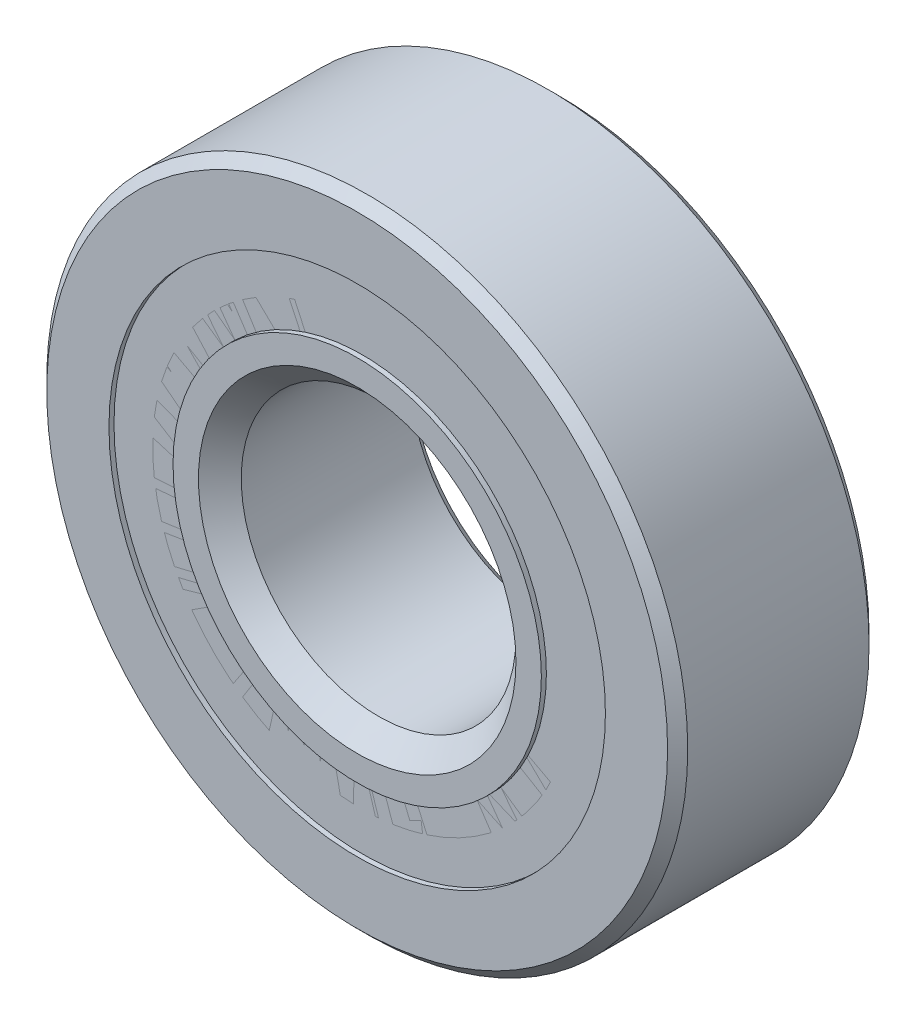
ISO-10303-21;
HEADER;
FILE_DESCRIPTION(('STEP AP214'),'2;1');
FILE_NAME('part.step','',(''),(''),'','','');
FILE_SCHEMA(('AUTOMOTIVE_DESIGN { 1 0 10303 214 1 1 1 1 }'));
ENDSEC;
DATA;
#1=APPLICATION_CONTEXT('core data for automotive mechanical design processes');
#2=APPLICATION_PROTOCOL_DEFINITION('international standard','automotive_design',2000,#1);
#3=PRODUCT_CONTEXT('',#1,'mechanical');
#4=PRODUCT('Part','Part','',(#3));
#5=PRODUCT_RELATED_PRODUCT_CATEGORY('part','',(#4));
#6=PRODUCT_DEFINITION_FORMATION('','',#4);
#7=PRODUCT_DEFINITION_CONTEXT('part definition',#1,'design');
#8=PRODUCT_DEFINITION('design','',#6,#7);
#9=PRODUCT_DEFINITION_SHAPE('','',#8);
#10=(LENGTH_UNIT() NAMED_UNIT(*) SI_UNIT(.MILLI.,.METRE.));
#11=(NAMED_UNIT(*) PLANE_ANGLE_UNIT() SI_UNIT($,.RADIAN.));
#12=(NAMED_UNIT(*) SI_UNIT($,.STERADIAN.) SOLID_ANGLE_UNIT());
#13=UNCERTAINTY_MEASURE_WITH_UNIT(LENGTH_MEASURE(1.E-05),#10,'distance_accuracy_value','');
#14=(GEOMETRIC_REPRESENTATION_CONTEXT(3) GLOBAL_UNCERTAINTY_ASSIGNED_CONTEXT((#13)) GLOBAL_UNIT_ASSIGNED_CONTEXT((#10,
#11,#12)) REPRESENTATION_CONTEXT('',''));
#15=CARTESIAN_POINT('',(0.,0.,0.));
#16=DIRECTION('',(0.,0.,1.));
#17=DIRECTION('',(1.,0.,0.));
#18=AXIS2_PLACEMENT_3D('',#15,#16,#17);
#19=CARTESIAN_POINT('',(0.,13.5549450549451,-5.22500000000001));
#20=DIRECTION('',(0.,0.,1.));
#21=DIRECTION('',(1.,0.,0.));
#22=AXIS2_PLACEMENT_3D('',#19,#20,#21);
#23=PLANE('',#22);
#24=CARTESIAN_POINT('',(0.,0.,-5.22500000000001));
#25=DIRECTION('',(0.,0.,1.));
#26=DIRECTION('',(1.,0.,0.));
#27=AXIS2_PLACEMENT_3D('',#24,#25,#26);
#28=CIRCLE('',#27,13.5549450549451);
#29=CARTESIAN_POINT('',(13.5549450549451,0.,-5.22500000000001));
#30=VERTEX_POINT('',#29);
#31=EDGE_CURVE('E58',#30,#30,#28,.T.);
#32=ORIENTED_EDGE('',*,*,#31,.F.);
#33=EDGE_LOOP('',(#32));
#34=FACE_BOUND('',#33,.T.);
#35=CARTESIAN_POINT('',(0.,0.,-5.22500000000001));
#36=DIRECTION('',(0.,0.,1.));
#37=DIRECTION('',(1.,0.,0.));
#38=AXIS2_PLACEMENT_3D('',#35,#36,#37);
#39=CIRCLE('',#38,10.0569347990905);
#40=CARTESIAN_POINT('',(10.0569347990905,0.,-5.22500000000001));
#41=VERTEX_POINT('',#40);
#42=EDGE_CURVE('E11',#41,#41,#39,.T.);
#43=ORIENTED_EDGE('',*,*,#42,.T.);
#44=EDGE_LOOP('',(#43));
#45=FACE_BOUND('',#44,.T.);
#46=ADVANCED_FACE('F44',(#34,#45),#23,.F.);
#47=CARTESIAN_POINT('',(0.,0.,5.5));
#48=DIRECTION('',(0.,0.,1.));
#49=DIRECTION('',(1.,0.,0.));
#50=AXIS2_PLACEMENT_3D('',#47,#48,#49);
#51=CYLINDRICAL_SURFACE('',#50,10.0569347990905);
#52=ORIENTED_EDGE('',*,*,#42,.F.);
#53=EDGE_LOOP('',(#52));
#54=FACE_BOUND('',#53,.T.);
#55=CARTESIAN_POINT('',(0.,0.,-2.66237069374803));
#56=DIRECTION('',(0.,0.,1.));
#57=DIRECTION('',(1.,0.,0.));
#58=AXIS2_PLACEMENT_3D('',#55,#56,#57);
#59=CIRCLE('',#58,10.0569347990905);
#60=CARTESIAN_POINT('',(10.0569347990905,0.,-2.66237069374803));
#61=VERTEX_POINT('',#60);
#62=EDGE_CURVE('E50',#61,#61,#59,.T.);
#63=ORIENTED_EDGE('',*,*,#62,.T.);
#64=EDGE_LOOP('',(#63));
#65=FACE_BOUND('',#64,.T.);
#66=ADVANCED_FACE('F67',(#54,#65),#51,.F.);
#67=CARTESIAN_POINT('',(0.,13.5549450549451,-2.66237069374803));
#68=DIRECTION('',(0.,0.,-1.));
#69=DIRECTION('',(-1.,0.,0.));
#70=AXIS2_PLACEMENT_3D('',#67,#68,#69);
#71=PLANE('',#70);
#72=ORIENTED_EDGE('',*,*,#62,.F.);
#73=EDGE_LOOP('',(#72));
#74=FACE_BOUND('',#73,.T.);
#75=CARTESIAN_POINT('',(0.,0.,-2.66237069374802));
#76=DIRECTION('',(0.,0.,1.));
#77=DIRECTION('',(1.,0.,0.));
#78=AXIS2_PLACEMENT_3D('',#75,#76,#77);
#79=CIRCLE('',#78,13.5549450549451);
#80=CARTESIAN_POINT('',(13.5549450549451,0.,-2.66237069374802));
#81=VERTEX_POINT('',#80);
#82=EDGE_CURVE('E54',#81,#81,#79,.T.);
#83=ORIENTED_EDGE('',*,*,#82,.T.);
#84=EDGE_LOOP('',(#83));
#85=FACE_BOUND('',#84,.T.);
#86=ADVANCED_FACE('F71',(#74,#85),#71,.F.);
#87=CARTESIAN_POINT('',(0.,0.,5.5));
#88=DIRECTION('',(0.,0.,1.));
#89=DIRECTION('',(1.,0.,0.));
#90=AXIS2_PLACEMENT_3D('',#87,#88,#89);
#91=CYLINDRICAL_SURFACE('',#90,13.5549450549451);
#92=ORIENTED_EDGE('',*,*,#82,.F.);
#93=EDGE_LOOP('',(#92));
#94=FACE_BOUND('',#93,.T.);
#95=ORIENTED_EDGE('',*,*,#31,.T.);
#96=EDGE_LOOP('',(#95));
#97=FACE_BOUND('',#96,.T.);
#98=ADVANCED_FACE('F64',(#94,#97),#91,.T.);
#99=CLOSED_SHELL('',(#46,#66,#86,#98));
#100=MANIFOLD_SOLID_BREP('B2',#99);
#101=CARTESIAN_POINT('',(0.,13.5549450549451,5.225));
#102=DIRECTION('',(0.,0.,-1.));
#103=DIRECTION('',(-1.,0.,0.));
#104=AXIS2_PLACEMENT_3D('',#101,#102,#103);
#105=PLANE('',#104);
#106=CARTESIAN_POINT('',(0.,0.,5.225));
#107=DIRECTION('',(0.,0.,1.));
#108=DIRECTION('',(1.,0.,0.));
#109=AXIS2_PLACEMENT_3D('',#106,#107,#108);
#110=CIRCLE('',#109,10.0569347990905);
#111=CARTESIAN_POINT('',(10.0569347990905,0.,5.225));
#112=VERTEX_POINT('',#111);
#113=EDGE_CURVE('E43',#112,#112,#110,.T.);
#114=ORIENTED_EDGE('',*,*,#113,.F.);
#115=EDGE_LOOP('',(#114));
#116=FACE_BOUND('',#115,.T.);
#117=CARTESIAN_POINT('',(0.,0.,5.225));
#118=DIRECTION('',(0.,0.,1.));
#119=DIRECTION('',(1.,0.,0.));
#120=AXIS2_PLACEMENT_3D('',#117,#118,#119);
#121=CIRCLE('',#120,13.5549450549451);
#122=CARTESIAN_POINT('',(13.5549450549451,0.,5.225));
#123=VERTEX_POINT('',#122);
#124=EDGE_CURVE('E140',#123,#123,#121,.T.);
#125=ORIENTED_EDGE('',*,*,#124,.T.);
#126=EDGE_LOOP('',(#125));
#127=FACE_BOUND('',#126,.T.);
#128=ADVANCED_FACE('F126',(#116,#127),#105,.F.);
#129=CARTESIAN_POINT('',(0.,0.,5.5));
#130=DIRECTION('',(0.,0.,1.));
#131=DIRECTION('',(1.,0.,0.));
#132=AXIS2_PLACEMENT_3D('',#129,#130,#131);
#133=CYLINDRICAL_SURFACE('',#132,10.0569347990905);
#134=CARTESIAN_POINT('',(0.,0.,2.66237069374802));
#135=DIRECTION('',(0.,0.,1.));
#136=DIRECTION('',(1.,0.,0.));
#137=AXIS2_PLACEMENT_3D('',#134,#135,#136);
#138=CIRCLE('',#137,10.0569347990905);
#139=CARTESIAN_POINT('',(10.0569347990905,0.,2.66237069374802));
#140=VERTEX_POINT('',#139);
#141=EDGE_CURVE('E132',#140,#140,#138,.T.);
#142=ORIENTED_EDGE('',*,*,#141,.F.);
#143=EDGE_LOOP('',(#142));
#144=FACE_BOUND('',#143,.T.);
#145=ORIENTED_EDGE('',*,*,#113,.T.);
#146=EDGE_LOOP('',(#145));
#147=FACE_BOUND('',#146,.T.);
#148=ADVANCED_FACE('F155',(#144,#147),#133,.F.);
#149=CARTESIAN_POINT('',(0.,13.5549450549451,2.66237069374802));
#150=DIRECTION('',(0.,0.,1.));
#151=DIRECTION('',(1.,0.,0.));
#152=AXIS2_PLACEMENT_3D('',#149,#150,#151);
#153=PLANE('',#152);
#154=CARTESIAN_POINT('',(0.,0.,2.66237069374802));
#155=DIRECTION('',(0.,0.,1.));
#156=DIRECTION('',(1.,0.,0.));
#157=AXIS2_PLACEMENT_3D('',#154,#155,#156);
#158=CIRCLE('',#157,13.5549450549451);
#159=CARTESIAN_POINT('',(13.5549450549451,0.,2.66237069374802));
#160=VERTEX_POINT('',#159);
#161=EDGE_CURVE('E136',#160,#160,#158,.T.);
#162=ORIENTED_EDGE('',*,*,#161,.F.);
#163=EDGE_LOOP('',(#162));
#164=FACE_BOUND('',#163,.T.);
#165=ORIENTED_EDGE('',*,*,#141,.T.);
#166=EDGE_LOOP('',(#165));
#167=FACE_BOUND('',#166,.T.);
#168=ADVANCED_FACE('F150',(#164,#167),#153,.F.);
#169=CARTESIAN_POINT('',(0.,0.,5.5));
#170=DIRECTION('',(0.,0.,1.));
#171=DIRECTION('',(1.,0.,0.));
#172=AXIS2_PLACEMENT_3D('',#169,#170,#171);
#173=CYLINDRICAL_SURFACE('',#172,13.5549450549451);
#174=ORIENTED_EDGE('',*,*,#124,.F.);
#175=EDGE_LOOP('',(#174));
#176=FACE_BOUND('',#175,.T.);
#177=ORIENTED_EDGE('',*,*,#161,.T.);
#178=EDGE_LOOP('',(#177));
#179=FACE_BOUND('',#178,.T.);
#180=ADVANCED_FACE('F147',(#176,#179),#173,.T.);
#181=CLOSED_SHELL('',(#128,#148,#168,#180));
#182=MANIFOLD_SOLID_BREP('B6',#181);
#183=CARTESIAN_POINT('',(-8.83883476483174,8.83883476483195,0.));
#184=DIRECTION('',(0.,0.,1.));
#185=DIRECTION('',(-0.707106781186539,0.707106781186556,0.));
#186=AXIS2_PLACEMENT_3D('',#183,#184,#185);
#187=SPHERICAL_SURFACE('',#186,2.66237069374802);
#188=CARTESIAN_POINT('',(-8.83883476483174,8.83883476483195,2.66237069374802));
#189=VERTEX_POINT('',#188);
#190=VERTEX_LOOP('',#189);
#191=FACE_BOUND('',#190,.T.);
#192=ADVANCED_FACE('F208',(#191),#187,.T.);
#193=CLOSED_SHELL('',(#192));
#194=MANIFOLD_SOLID_BREP('B38',#193);
#195=CARTESIAN_POINT('',(-12.5,1.30930550206618E-13,0.));
#196=DIRECTION('',(0.,0.,1.));
#197=DIRECTION('',(-1.,0.,0.));
#198=AXIS2_PLACEMENT_3D('',#195,#196,#197);
#199=SPHERICAL_SURFACE('',#198,2.66237069374802);
#200=CARTESIAN_POINT('',(-12.5,1.30930550206618E-13,2.66237069374802));
#201=VERTEX_POINT('',#200);
#202=VERTEX_LOOP('',#201);
#203=FACE_BOUND('',#202,.T.);
#204=ADVANCED_FACE('F241',(#203),#199,.T.);
#205=CLOSED_SHELL('',(#204));
#206=MANIFOLD_SOLID_BREP('B122',#205);
#207=CARTESIAN_POINT('',(-8.83883476483192,-8.83883476483177,0.));
#208=DIRECTION('',(0.,0.,1.));
#209=DIRECTION('',(-0.707106781186554,-0.707106781186541,0.));
#210=AXIS2_PLACEMENT_3D('',#207,#208,#209);
#211=SPHERICAL_SURFACE('',#210,2.66237069374802);
#212=CARTESIAN_POINT('',(-8.83883476483192,-8.83883476483177,2.66237069374802));
#213=VERTEX_POINT('',#212);
#214=VERTEX_LOOP('',#213);
#215=FACE_BOUND('',#214,.T.);
#216=ADVANCED_FACE('F274',(#215),#211,.T.);
#217=CLOSED_SHELL('',(#216));
#218=MANIFOLD_SOLID_BREP('B204',#217);
#219=CARTESIAN_POINT('',(0.,-12.5,0.));
#220=DIRECTION('',(0.,0.,1.));
#221=DIRECTION('',(0.,-1.,0.));
#222=AXIS2_PLACEMENT_3D('',#219,#220,#221);
#223=SPHERICAL_SURFACE('',#222,2.66237069374802);
#224=CARTESIAN_POINT('',(0.,-12.5,2.66237069374802));
#225=VERTEX_POINT('',#224);
#226=VERTEX_LOOP('',#225);
#227=FACE_BOUND('',#226,.T.);
#228=ADVANCED_FACE('F307',(#227),#223,.T.);
#229=CLOSED_SHELL('',(#228));
#230=MANIFOLD_SOLID_BREP('B237',#229);
#231=CARTESIAN_POINT('',(8.8388347648318,-8.83883476483189,0.));
#232=DIRECTION('',(0.,0.,1.));
#233=DIRECTION('',(0.707106781186544,-0.707106781186551,0.));
#234=AXIS2_PLACEMENT_3D('',#231,#232,#233);
#235=SPHERICAL_SURFACE('',#234,2.66237069374802);
#236=CARTESIAN_POINT('',(8.8388347648318,-8.83883476483189,2.66237069374802));
#237=VERTEX_POINT('',#236);
#238=VERTEX_LOOP('',#237);
#239=FACE_BOUND('',#238,.T.);
#240=ADVANCED_FACE('F340',(#239),#235,.T.);
#241=CLOSED_SHELL('',(#240));
#242=MANIFOLD_SOLID_BREP('B270',#241);
#243=CARTESIAN_POINT('',(12.5,0.,0.));
#244=DIRECTION('',(0.,0.,1.));
#245=DIRECTION('',(1.,0.,0.));
#246=AXIS2_PLACEMENT_3D('',#243,#244,#245);
#247=SPHERICAL_SURFACE('',#246,2.66237069374802);
#248=CARTESIAN_POINT('',(12.5,0.,2.66237069374802));
#249=VERTEX_POINT('',#248);
#250=VERTEX_LOOP('',#249);
#251=FACE_BOUND('',#250,.T.);
#252=ADVANCED_FACE('F373',(#251),#247,.T.);
#253=CLOSED_SHELL('',(#252));
#254=MANIFOLD_SOLID_BREP('B303',#253);
#255=CARTESIAN_POINT('',(8.83883476483186,8.83883476483183,0.));
#256=DIRECTION('',(0.,0.,1.));
#257=DIRECTION('',(0.707106781186549,0.707106781186546,0.));
#258=AXIS2_PLACEMENT_3D('',#255,#256,#257);
#259=SPHERICAL_SURFACE('',#258,2.66237069374802);
#260=CARTESIAN_POINT('',(8.83883476483186,8.83883476483183,2.66237069374802));
#261=VERTEX_POINT('',#260);
#262=VERTEX_LOOP('',#261);
#263=FACE_BOUND('',#262,.T.);
#264=ADVANCED_FACE('F406',(#263),#259,.T.);
#265=CLOSED_SHELL('',(#264));
#266=MANIFOLD_SOLID_BREP('B336',#265);
#267=CARTESIAN_POINT('',(0.,12.5,0.));
#268=DIRECTION('',(0.,0.,1.));
#269=DIRECTION('',(0.,1.,0.));
#270=AXIS2_PLACEMENT_3D('',#267,#268,#269);
#271=SPHERICAL_SURFACE('',#270,2.66237069374802);
#272=CARTESIAN_POINT('',(0.,12.5,2.66237069374802));
#273=VERTEX_POINT('',#272);
#274=VERTEX_LOOP('',#273);
#275=FACE_BOUND('',#274,.T.);
#276=ADVANCED_FACE('F441',(#275),#271,.T.);
#277=CLOSED_SHELL('',(#276));
#278=MANIFOLD_SOLID_BREP('B369',#277);
#279=CARTESIAN_POINT('',(0.,0.,5.5));
#280=DIRECTION('',(0.,0.,1.));
#281=DIRECTION('',(1.,0.,0.));
#282=AXIS2_PLACEMENT_3D('',#279,#280,#281);
#283=CYLINDRICAL_SURFACE('',#282,10.0569347990905);
#284=CARTESIAN_POINT('',(0.,0.,5.5));
#285=DIRECTION('',(0.,0.,1.));
#286=DIRECTION('',(1.,0.,0.));
#287=AXIS2_PLACEMENT_3D('',#284,#285,#286);
#288=CIRCLE('',#287,10.0569347990905);
#289=CARTESIAN_POINT('',(10.0569347990905,0.,5.5));
#290=VERTEX_POINT('',#289);
#291=EDGE_CURVE('E502',#290,#290,#288,.T.);
#292=ORIENTED_EDGE('',*,*,#291,.F.);
#293=EDGE_LOOP('',(#292));
#294=FACE_BOUND('',#293,.T.);
#295=CARTESIAN_POINT('',(0.,0.,5.225));
#296=DIRECTION('',(0.,0.,1.));
#297=DIRECTION('',(1.,0.,0.));
#298=AXIS2_PLACEMENT_3D('',#295,#296,#297);
#299=CIRCLE('',#298,10.0569347990905);
#300=CARTESIAN_POINT('',(10.0569347990905,0.,5.225));
#301=VERTEX_POINT('',#300);
#302=EDGE_CURVE('E440',#301,#301,#299,.T.);
#303=ORIENTED_EDGE('',*,*,#302,.T.);
#304=EDGE_LOOP('',(#303));
#305=FACE_BOUND('',#304,.T.);
#306=ADVANCED_FACE('F462',(#294,#305),#283,.T.);
#307=CARTESIAN_POINT('',(0.,10.0569347990905,5.225));
#308=DIRECTION('',(0.,0.,1.));
#309=DIRECTION('',(1.,0.,0.));
#310=AXIS2_PLACEMENT_3D('',#307,#308,#309);
#311=PLANE('',#310);
#312=ORIENTED_EDGE('',*,*,#302,.F.);
#313=EDGE_LOOP('',(#312));
#314=FACE_BOUND('',#313,.T.);
#315=CARTESIAN_POINT('',(0.,0.,5.225));
#316=DIRECTION('',(0.,0.,1.));
#317=DIRECTION('',(1.,0.,0.));
#318=AXIS2_PLACEMENT_3D('',#315,#316,#317);
#319=CIRCLE('',#318,9.78193479909047);
#320=CARTESIAN_POINT('',(9.78193479909047,0.,5.225));
#321=VERTEX_POINT('',#320);
#322=EDGE_CURVE('E468',#321,#321,#319,.T.);
#323=ORIENTED_EDGE('',*,*,#322,.T.);
#324=EDGE_LOOP('',(#323));
#325=FACE_BOUND('',#324,.T.);
#326=ADVANCED_FACE('F509',(#314,#325),#311,.F.);
#327=CARTESIAN_POINT('',(0.,0.,4.11187985403553));
#328=DIRECTION('',(0.,0.,1.));
#329=DIRECTION('',(1.,0.,0.));
#330=AXIS2_PLACEMENT_3D('',#327,#328,#329);
#331=CONICAL_SURFACE('',#330,8.66881465312599,0.78539816339745);
#332=ORIENTED_EDGE('',*,*,#322,.F.);
#333=EDGE_LOOP('',(#332));
#334=FACE_BOUND('',#333,.T.);
#335=CARTESIAN_POINT('',(0.,0.,4.11187985403553));
#336=DIRECTION('',(0.,0.,1.));
#337=DIRECTION('',(1.,0.,0.));
#338=AXIS2_PLACEMENT_3D('',#335,#336,#337);
#339=CIRCLE('',#338,8.66881465312599);
#340=CARTESIAN_POINT('',(8.66881465312599,0.,4.11187985403553));
#341=VERTEX_POINT('',#340);
#342=EDGE_CURVE('E472',#341,#341,#339,.T.);
#343=ORIENTED_EDGE('',*,*,#342,.T.);
#344=EDGE_LOOP('',(#343));
#345=FACE_BOUND('',#344,.T.);
#346=ADVANCED_FACE('F513',(#334,#345),#331,.T.);
#347=CARTESIAN_POINT('',(0.,0.,5.5));
#348=DIRECTION('',(0.,0.,1.));
#349=DIRECTION('',(1.,0.,0.));
#350=AXIS2_PLACEMENT_3D('',#347,#348,#349);
#351=CYLINDRICAL_SURFACE('',#350,8.66881465312599);
#352=ORIENTED_EDGE('',*,*,#342,.F.);
#353=EDGE_LOOP('',(#352));
#354=FACE_BOUND('',#353,.T.);
#355=CARTESIAN_POINT('',(0.,0.,0.));
#356=DIRECTION('',(0.,0.,1.));
#357=DIRECTION('',(1.,0.,0.));
#358=AXIS2_PLACEMENT_3D('',#355,#356,#357);
#359=CIRCLE('',#358,8.66881465312599);
#360=CARTESIAN_POINT('',(8.66881465312599,0.,0.));
#361=VERTEX_POINT('',#360);
#362=EDGE_CURVE('E476',#361,#361,#359,.T.);
#363=ORIENTED_EDGE('',*,*,#362,.T.);
#364=EDGE_LOOP('',(#363));
#365=FACE_BOUND('',#364,.T.);
#366=ADVANCED_FACE('F518',(#354,#365),#351,.T.);
#367=CARTESIAN_POINT('',(0.,8.66881465312599,0.));
#368=DIRECTION('',(0.,0.,-1.));
#369=DIRECTION('',(-1.,0.,0.));
#370=AXIS2_PLACEMENT_3D('',#367,#368,#369);
#371=PLANE('',#370);
#372=ORIENTED_EDGE('',*,*,#362,.F.);
#373=EDGE_LOOP('',(#372));
#374=FACE_BOUND('',#373,.T.);
#375=CARTESIAN_POINT('',(0.,0.,0.));
#376=DIRECTION('',(0.,0.,1.));
#377=DIRECTION('',(1.,0.,0.));
#378=AXIS2_PLACEMENT_3D('',#375,#376,#377);
#379=CIRCLE('',#378,9.83762930625198);
#380=CARTESIAN_POINT('',(9.83762930625198,0.,0.));
#381=VERTEX_POINT('',#380);
#382=EDGE_CURVE('E481',#381,#381,#379,.T.);
#383=ORIENTED_EDGE('',*,*,#382,.T.);
#384=EDGE_LOOP('',(#383));
#385=FACE_BOUND('',#384,.T.);
#386=ADVANCED_FACE('F524',(#374,#385),#371,.F.);
#387=CARTESIAN_POINT('',(0.,0.,0.));
#388=DIRECTION('',(0.,0.,1.));
#389=DIRECTION('',(1.,0.,0.));
#390=AXIS2_PLACEMENT_3D('',#387,#388,#389);
#391=TOROIDAL_SURFACE('',#390,12.5,2.66237069374802);
#392=ORIENTED_EDGE('',*,*,#382,.F.);
#393=EDGE_LOOP('',(#392));
#394=FACE_BOUND('',#393,.T.);
#395=CARTESIAN_POINT('',(0.,0.,-2.44444444444444));
#396=DIRECTION('',(0.,0.,1.));
#397=DIRECTION('',(1.,0.,0.));
#398=AXIS2_PLACEMENT_3D('',#395,#396,#397);
#399=CIRCLE('',#398,11.445054945055);
#400=CARTESIAN_POINT('',(11.445054945055,0.,-2.44444444444444));
#401=VERTEX_POINT('',#400);
#402=EDGE_CURVE('E484',#401,#401,#399,.T.);
#403=ORIENTED_EDGE('',*,*,#402,.T.);
#404=EDGE_LOOP('',(#403));
#405=FACE_BOUND('',#404,.T.);
#406=ADVANCED_FACE('F528',(#394,#405),#391,.F.);
#407=CARTESIAN_POINT('',(0.,0.,5.5));
#408=DIRECTION('',(0.,0.,1.));
#409=DIRECTION('',(1.,0.,0.));
#410=AXIS2_PLACEMENT_3D('',#407,#408,#409);
#411=CYLINDRICAL_SURFACE('',#410,11.445054945055);
#412=ORIENTED_EDGE('',*,*,#402,.F.);
#413=EDGE_LOOP('',(#412));
#414=FACE_BOUND('',#413,.T.);
#415=CARTESIAN_POINT('',(0.,0.,-5.50000000000001));
#416=DIRECTION('',(0.,0.,1.));
#417=DIRECTION('',(1.,0.,0.));
#418=AXIS2_PLACEMENT_3D('',#415,#416,#417);
#419=CIRCLE('',#418,11.445054945055);
#420=CARTESIAN_POINT('',(11.445054945055,0.,-5.50000000000001));
#421=VERTEX_POINT('',#420);
#422=EDGE_CURVE('E487',#421,#421,#419,.T.);
#423=ORIENTED_EDGE('',*,*,#422,.T.);
#424=EDGE_LOOP('',(#423));
#425=FACE_BOUND('',#424,.T.);
#426=ADVANCED_FACE('F532',(#414,#425),#411,.T.);
#427=CARTESIAN_POINT('',(0.,8.05,-5.50000000000001));
#428=DIRECTION('',(0.,0.,1.));
#429=DIRECTION('',(1.,0.,0.));
#430=AXIS2_PLACEMENT_3D('',#427,#428,#429);
#431=PLANE('',#430);
#432=ORIENTED_EDGE('',*,*,#422,.F.);
#433=EDGE_LOOP('',(#432));
#434=FACE_BOUND('',#433,.T.);
#435=CARTESIAN_POINT('',(0.,0.,-5.50000000000001));
#436=DIRECTION('',(0.,0.,1.));
#437=DIRECTION('',(1.,0.,0.));
#438=AXIS2_PLACEMENT_3D('',#435,#436,#437);
#439=CIRCLE('',#438,8.05);
#440=CARTESIAN_POINT('',(8.05,0.,-5.50000000000001));
#441=VERTEX_POINT('',#440);
#442=EDGE_CURVE('E490',#441,#441,#439,.T.);
#443=ORIENTED_EDGE('',*,*,#442,.T.);
#444=EDGE_LOOP('',(#443));
#445=FACE_BOUND('',#444,.T.);
#446=ADVANCED_FACE('F536',(#434,#445),#431,.F.);
#447=CARTESIAN_POINT('',(0.,0.,-4.95000000000001));
#448=DIRECTION('',(0.,0.,-1.));
#449=DIRECTION('',(-1.,0.,0.));
#450=AXIS2_PLACEMENT_3D('',#447,#448,#449);
#451=CONICAL_SURFACE('',#450,7.5,0.785398163397447);
#452=ORIENTED_EDGE('',*,*,#442,.F.);
#453=EDGE_LOOP('',(#452));
#454=FACE_BOUND('',#453,.T.);
#455=CARTESIAN_POINT('',(0.,0.,-4.95000000000001));
#456=DIRECTION('',(0.,0.,1.));
#457=DIRECTION('',(1.,0.,0.));
#458=AXIS2_PLACEMENT_3D('',#455,#456,#457);
#459=CIRCLE('',#458,7.5);
#460=CARTESIAN_POINT('',(7.5,0.,-4.95000000000001));
#461=VERTEX_POINT('',#460);
#462=EDGE_CURVE('E493',#461,#461,#459,.T.);
#463=ORIENTED_EDGE('',*,*,#462,.T.);
#464=EDGE_LOOP('',(#463));
#465=FACE_BOUND('',#464,.T.);
#466=ADVANCED_FACE('F540',(#454,#465),#451,.F.);
#467=CARTESIAN_POINT('',(0.,0.,5.5));
#468=DIRECTION('',(0.,0.,1.));
#469=DIRECTION('',(1.,0.,0.));
#470=AXIS2_PLACEMENT_3D('',#467,#468,#469);
#471=CYLINDRICAL_SURFACE('',#470,7.5);
#472=ORIENTED_EDGE('',*,*,#462,.F.);
#473=EDGE_LOOP('',(#472));
#474=FACE_BOUND('',#473,.T.);
#475=CARTESIAN_POINT('',(0.,0.,4.33118534687402));
#476=DIRECTION('',(0.,0.,1.));
#477=DIRECTION('',(1.,0.,0.));
#478=AXIS2_PLACEMENT_3D('',#475,#476,#477);
#479=CIRCLE('',#478,7.5);
#480=CARTESIAN_POINT('',(7.5,0.,4.33118534687402));
#481=VERTEX_POINT('',#480);
#482=EDGE_CURVE('E496',#481,#481,#479,.T.);
#483=ORIENTED_EDGE('',*,*,#482,.T.);
#484=EDGE_LOOP('',(#483));
#485=FACE_BOUND('',#484,.T.);
#486=ADVANCED_FACE('F544',(#474,#485),#471,.F.);
#487=CARTESIAN_POINT('',(0.,0.,5.5));
#488=DIRECTION('',(0.,0.,1.));
#489=DIRECTION('',(1.,0.,0.));
#490=AXIS2_PLACEMENT_3D('',#487,#488,#489);
#491=CONICAL_SURFACE('',#490,8.66881465312599,0.78539816339745);
#492=ORIENTED_EDGE('',*,*,#482,.F.);
#493=EDGE_LOOP('',(#492));
#494=FACE_BOUND('',#493,.T.);
#495=CARTESIAN_POINT('',(0.,0.,5.5));
#496=DIRECTION('',(0.,0.,1.));
#497=DIRECTION('',(1.,0.,0.));
#498=AXIS2_PLACEMENT_3D('',#495,#496,#497);
#499=CIRCLE('',#498,8.66881465312599);
#500=CARTESIAN_POINT('',(8.66881465312599,0.,5.5));
#501=VERTEX_POINT('',#500);
#502=EDGE_CURVE('E499',#501,#501,#499,.T.);
#503=ORIENTED_EDGE('',*,*,#502,.T.);
#504=EDGE_LOOP('',(#503));
#505=FACE_BOUND('',#504,.T.);
#506=ADVANCED_FACE('F548',(#494,#505),#491,.F.);
#507=CARTESIAN_POINT('',(0.,10.0569347990905,5.5));
#508=DIRECTION('',(0.,0.,-1.));
#509=DIRECTION('',(-1.,0.,0.));
#510=AXIS2_PLACEMENT_3D('',#507,#508,#509);
#511=PLANE('',#510);
#512=ORIENTED_EDGE('',*,*,#502,.F.);
#513=EDGE_LOOP('',(#512));
#514=FACE_BOUND('',#513,.T.);
#515=ORIENTED_EDGE('',*,*,#291,.T.);
#516=EDGE_LOOP('',(#515));
#517=FACE_BOUND('',#516,.T.);
#518=ADVANCED_FACE('F506',(#514,#517),#511,.F.);
#519=CLOSED_SHELL('',(#306,#326,#346,#366,#386,#406,#426,#446,#466,#486,#506,#518));
#520=MANIFOLD_SOLID_BREP('B402',#519);
#521=CARTESIAN_POINT('',(0.,0.,0.));
#522=DIRECTION('',(0.,0.,1.));
#523=DIRECTION('',(1.,0.,0.));
#524=AXIS2_PLACEMENT_3D('',#521,#522,#523);
#525=TOROIDAL_SURFACE('',#524,12.5,2.66237069374802);
#526=CARTESIAN_POINT('',(0.,0.,2.44444444444444));
#527=DIRECTION('',(0.,0.,1.));
#528=DIRECTION('',(1.,0.,0.));
#529=AXIS2_PLACEMENT_3D('',#526,#527,#528);
#530=CIRCLE('',#529,11.445054945055);
#531=CARTESIAN_POINT('',(11.445054945055,0.,2.44444444444444));
#532=VERTEX_POINT('',#531);
#533=EDGE_CURVE('E461',#532,#532,#530,.T.);
#534=ORIENTED_EDGE('',*,*,#533,.F.);
#535=EDGE_LOOP('',(#534));
#536=FACE_BOUND('',#535,.T.);
#537=CARTESIAN_POINT('',(0.,0.,0.));
#538=DIRECTION('',(0.,0.,1.));
#539=DIRECTION('',(1.,0.,0.));
#540=AXIS2_PLACEMENT_3D('',#537,#538,#539);
#541=CIRCLE('',#540,9.83762930625198);
#542=CARTESIAN_POINT('',(9.83762930625198,0.,0.));
#543=VERTEX_POINT('',#542);
#544=EDGE_CURVE('E673',#543,#543,#541,.T.);
#545=ORIENTED_EDGE('',*,*,#544,.T.);
#546=EDGE_LOOP('',(#545));
#547=FACE_BOUND('',#546,.T.);
#548=ADVANCED_FACE('F651',(#536,#547),#525,.F.);
#549=CARTESIAN_POINT('',(0.,0.,5.5));
#550=DIRECTION('',(0.,0.,1.));
#551=DIRECTION('',(1.,0.,0.));
#552=AXIS2_PLACEMENT_3D('',#549,#550,#551);
#553=CYLINDRICAL_SURFACE('',#552,11.445054945055);
#554=CARTESIAN_POINT('',(0.,0.,5.225));
#555=DIRECTION('',(0.,0.,1.));
#556=DIRECTION('',(1.,0.,0.));
#557=AXIS2_PLACEMENT_3D('',#554,#555,#556);
#558=CIRCLE('',#557,11.445054945055);
#559=CARTESIAN_POINT('',(11.445054945055,0.,5.225));
#560=VERTEX_POINT('',#559);
#561=EDGE_CURVE('E657',#560,#560,#558,.T.);
#562=ORIENTED_EDGE('',*,*,#561,.F.);
#563=EDGE_LOOP('',(#562));
#564=FACE_BOUND('',#563,.T.);
#565=ORIENTED_EDGE('',*,*,#533,.T.);
#566=EDGE_LOOP('',(#565));
#567=FACE_BOUND('',#566,.T.);
#568=ADVANCED_FACE('F698',(#564,#567),#553,.T.);
#569=CARTESIAN_POINT('',(0.,11.445054945055,5.225));
#570=DIRECTION('',(0.,0.,-1.));
#571=DIRECTION('',(-1.,0.,0.));
#572=AXIS2_PLACEMENT_3D('',#569,#570,#571);
#573=PLANE('',#572);
#574=CARTESIAN_POINT('',(0.,0.,5.225));
#575=DIRECTION('',(0.,0.,1.));
#576=DIRECTION('',(1.,0.,0.));
#577=AXIS2_PLACEMENT_3D('',#574,#575,#576);
#578=CIRCLE('',#577,9.78193479909047);
#579=CARTESIAN_POINT('',(9.78193479909047,0.,5.225));
#580=VERTEX_POINT('',#579);
#581=EDGE_CURVE('E661',#580,#580,#578,.T.);
#582=ORIENTED_EDGE('',*,*,#581,.F.);
#583=EDGE_LOOP('',(#582));
#584=FACE_BOUND('',#583,.T.);
#585=ORIENTED_EDGE('',*,*,#561,.T.);
#586=EDGE_LOOP('',(#585));
#587=FACE_BOUND('',#586,.T.);
#588=ADVANCED_FACE('F693',(#584,#587),#573,.F.);
#589=CARTESIAN_POINT('',(0.,0.,5.225));
#590=DIRECTION('',(0.,0.,1.));
#591=DIRECTION('',(1.,0.,0.));
#592=AXIS2_PLACEMENT_3D('',#589,#590,#591);
#593=CONICAL_SURFACE('',#592,9.78193479909047,0.78539816339745);
#594=CARTESIAN_POINT('',(0.,0.,4.11187985403553));
#595=DIRECTION('',(0.,0.,1.));
#596=DIRECTION('',(1.,0.,0.));
#597=AXIS2_PLACEMENT_3D('',#594,#595,#596);
#598=CIRCLE('',#597,8.66881465312599);
#599=CARTESIAN_POINT('',(8.66881465312599,0.,4.11187985403553));
#600=VERTEX_POINT('',#599);
#601=EDGE_CURVE('E665',#600,#600,#598,.T.);
#602=ORIENTED_EDGE('',*,*,#601,.F.);
#603=EDGE_LOOP('',(#602));
#604=FACE_BOUND('',#603,.T.);
#605=ORIENTED_EDGE('',*,*,#581,.T.);
#606=EDGE_LOOP('',(#605));
#607=FACE_BOUND('',#606,.T.);
#608=ADVANCED_FACE('F687',(#604,#607),#593,.F.);
#609=CARTESIAN_POINT('',(0.,0.,5.5));
#610=DIRECTION('',(0.,0.,1.));
#611=DIRECTION('',(1.,0.,0.));
#612=AXIS2_PLACEMENT_3D('',#609,#610,#611);
#613=CYLINDRICAL_SURFACE('',#612,8.66881465312599);
#614=CARTESIAN_POINT('',(0.,0.,0.));
#615=DIRECTION('',(0.,0.,1.));
#616=DIRECTION('',(1.,0.,0.));
#617=AXIS2_PLACEMENT_3D('',#614,#615,#616);
#618=CIRCLE('',#617,8.66881465312599);
#619=CARTESIAN_POINT('',(8.66881465312599,0.,0.));
#620=VERTEX_POINT('',#619);
#621=EDGE_CURVE('E670',#620,#620,#618,.T.);
#622=ORIENTED_EDGE('',*,*,#621,.F.);
#623=EDGE_LOOP('',(#622));
#624=FACE_BOUND('',#623,.T.);
#625=ORIENTED_EDGE('',*,*,#601,.T.);
#626=EDGE_LOOP('',(#625));
#627=FACE_BOUND('',#626,.T.);
#628=ADVANCED_FACE('F681',(#624,#627),#613,.F.);
#629=CARTESIAN_POINT('',(0.,8.66881465312599,0.));
#630=DIRECTION('',(0.,0.,1.));
#631=DIRECTION('',(1.,0.,0.));
#632=AXIS2_PLACEMENT_3D('',#629,#630,#631);
#633=PLANE('',#632);
#634=ORIENTED_EDGE('',*,*,#544,.F.);
#635=EDGE_LOOP('',(#634));
#636=FACE_BOUND('',#635,.T.);
#637=ORIENTED_EDGE('',*,*,#621,.T.);
#638=EDGE_LOOP('',(#637));
#639=FACE_BOUND('',#638,.T.);
#640=ADVANCED_FACE('F678',(#636,#639),#633,.F.);
#641=CLOSED_SHELL('',(#548,#568,#588,#608,#628,#640));
#642=MANIFOLD_SOLID_BREP('B435',#641);
#643=CARTESIAN_POINT('',(0.,0.,4.95));
#644=DIRECTION('',(0.,0.,-1.));
#645=DIRECTION('',(-1.,0.,0.));
#646=AXIS2_PLACEMENT_3D('',#643,#644,#645);
#647=CONICAL_SURFACE('',#646,17.5,0.785398163397453);
#648=CARTESIAN_POINT('',(0.,0.,5.5));
#649=DIRECTION('',(0.,0.,1.));
#650=DIRECTION('',(1.,0.,0.));
#651=AXIS2_PLACEMENT_3D('',#648,#649,#650);
#652=CIRCLE('',#651,16.95);
#653=CARTESIAN_POINT('',(16.95,0.,5.5));
#654=VERTEX_POINT('',#653);
#655=EDGE_CURVE('E787',#654,#654,#652,.T.);
#656=ORIENTED_EDGE('',*,*,#655,.F.);
#657=EDGE_LOOP('',(#656));
#658=FACE_BOUND('',#657,.T.);
#659=CARTESIAN_POINT('',(0.,0.,4.95));
#660=DIRECTION('',(0.,0.,1.));
#661=DIRECTION('',(1.,0.,0.));
#662=AXIS2_PLACEMENT_3D('',#659,#660,#661);
#663=CIRCLE('',#662,17.5);
#664=CARTESIAN_POINT('',(17.5,0.,4.95));
#665=VERTEX_POINT('',#664);
#666=EDGE_CURVE('E650',#665,#665,#663,.T.);
#667=ORIENTED_EDGE('',*,*,#666,.T.);
#668=EDGE_LOOP('',(#667));
#669=FACE_BOUND('',#668,.T.);
#670=ADVANCED_FACE('F759',(#658,#669),#647,.T.);
#671=CARTESIAN_POINT('',(0.,0.,5.5));
#672=DIRECTION('',(0.,0.,1.));
#673=DIRECTION('',(1.,0.,0.));
#674=AXIS2_PLACEMENT_3D('',#671,#672,#673);
#675=CYLINDRICAL_SURFACE('',#674,17.5);
#676=ORIENTED_EDGE('',*,*,#666,.F.);
#677=EDGE_LOOP('',(#676));
#678=FACE_BOUND('',#677,.T.);
#679=CARTESIAN_POINT('',(0.,0.,-4.95000000000001));
#680=DIRECTION('',(0.,0.,1.));
#681=DIRECTION('',(1.,0.,0.));
#682=AXIS2_PLACEMENT_3D('',#679,#680,#681);
#683=CIRCLE('',#682,17.5);
#684=CARTESIAN_POINT('',(17.5,0.,-4.95000000000001));
#685=VERTEX_POINT('',#684);
#686=EDGE_CURVE('E765',#685,#685,#683,.T.);
#687=ORIENTED_EDGE('',*,*,#686,.T.);
#688=EDGE_LOOP('',(#687));
#689=FACE_BOUND('',#688,.T.);
#690=ADVANCED_FACE('F794',(#678,#689),#675,.T.);
#691=CARTESIAN_POINT('',(0.,0.,-5.50000000000001));
#692=DIRECTION('',(0.,0.,1.));
#693=DIRECTION('',(1.,0.,0.));
#694=AXIS2_PLACEMENT_3D('',#691,#692,#693);
#695=CONICAL_SURFACE('',#694,16.95,0.785398163397455);
#696=ORIENTED_EDGE('',*,*,#686,.F.);
#697=EDGE_LOOP('',(#696));
#698=FACE_BOUND('',#697,.T.);
#699=CARTESIAN_POINT('',(0.,0.,-5.50000000000001));
#700=DIRECTION('',(0.,0.,1.));
#701=DIRECTION('',(1.,0.,0.));
#702=AXIS2_PLACEMENT_3D('',#699,#700,#701);
#703=CIRCLE('',#702,16.95);
#704=CARTESIAN_POINT('',(16.95,0.,-5.50000000000001));
#705=VERTEX_POINT('',#704);
#706=EDGE_CURVE('E769',#705,#705,#703,.T.);
#707=ORIENTED_EDGE('',*,*,#706,.T.);
#708=EDGE_LOOP('',(#707));
#709=FACE_BOUND('',#708,.T.);
#710=ADVANCED_FACE('F798',(#698,#709),#695,.T.);
#711=CARTESIAN_POINT('',(0.,16.95,-5.50000000000001));
#712=DIRECTION('',(0.,0.,1.));
#713=DIRECTION('',(1.,0.,0.));
#714=AXIS2_PLACEMENT_3D('',#711,#712,#713);
#715=PLANE('',#714);
#716=ORIENTED_EDGE('',*,*,#706,.F.);
#717=EDGE_LOOP('',(#716));
#718=FACE_BOUND('',#717,.T.);
#719=CARTESIAN_POINT('',(0.,0.,-5.50000000000001));
#720=DIRECTION('',(0.,0.,1.));
#721=DIRECTION('',(1.,0.,0.));
#722=AXIS2_PLACEMENT_3D('',#719,#720,#721);
#723=CIRCLE('',#722,13.5549450549451);
#724=CARTESIAN_POINT('',(13.5549450549451,0.,-5.50000000000001));
#725=VERTEX_POINT('',#724);
#726=EDGE_CURVE('E773',#725,#725,#723,.T.);
#727=ORIENTED_EDGE('',*,*,#726,.T.);
#728=EDGE_LOOP('',(#727));
#729=FACE_BOUND('',#728,.T.);
#730=ADVANCED_FACE('F803',(#718,#729),#715,.F.);
#731=CARTESIAN_POINT('',(0.,0.,5.5));
#732=DIRECTION('',(0.,0.,1.));
#733=DIRECTION('',(1.,0.,0.));
#734=AXIS2_PLACEMENT_3D('',#731,#732,#733);
#735=CYLINDRICAL_SURFACE('',#734,13.5549450549451);
#736=ORIENTED_EDGE('',*,*,#726,.F.);
#737=EDGE_LOOP('',(#736));
#738=FACE_BOUND('',#737,.T.);
#739=CARTESIAN_POINT('',(0.,0.,-2.44444444444445));
#740=DIRECTION('',(0.,0.,1.));
#741=DIRECTION('',(1.,0.,0.));
#742=AXIS2_PLACEMENT_3D('',#739,#740,#741);
#743=CIRCLE('',#742,13.5549450549451);
#744=CARTESIAN_POINT('',(13.5549450549451,0.,-2.44444444444445));
#745=VERTEX_POINT('',#744);
#746=EDGE_CURVE('E778',#745,#745,#743,.T.);
#747=ORIENTED_EDGE('',*,*,#746,.T.);
#748=EDGE_LOOP('',(#747));
#749=FACE_BOUND('',#748,.T.);
#750=ADVANCED_FACE('F809',(#738,#749),#735,.F.);
#751=CARTESIAN_POINT('',(0.,0.,0.));
#752=DIRECTION('',(0.,0.,1.));
#753=DIRECTION('',(1.,0.,0.));
#754=AXIS2_PLACEMENT_3D('',#751,#752,#753);
#755=TOROIDAL_SURFACE('',#754,12.5,2.66237069374802);
#756=ORIENTED_EDGE('',*,*,#746,.F.);
#757=EDGE_LOOP('',(#756));
#758=FACE_BOUND('',#757,.T.);
#759=CARTESIAN_POINT('',(0.,0.,2.44444444444444));
#760=DIRECTION('',(0.,0.,1.));
#761=DIRECTION('',(1.,0.,0.));
#762=AXIS2_PLACEMENT_3D('',#759,#760,#761);
#763=CIRCLE('',#762,13.5549450549451);
#764=CARTESIAN_POINT('',(13.5549450549451,0.,2.44444444444444));
#765=VERTEX_POINT('',#764);
#766=EDGE_CURVE('E781',#765,#765,#763,.T.);
#767=ORIENTED_EDGE('',*,*,#766,.T.);
#768=EDGE_LOOP('',(#767));
#769=FACE_BOUND('',#768,.T.);
#770=ADVANCED_FACE('F813',(#758,#769),#755,.F.);
#771=CARTESIAN_POINT('',(0.,0.,5.5));
#772=DIRECTION('',(0.,0.,1.));
#773=DIRECTION('',(1.,0.,0.));
#774=AXIS2_PLACEMENT_3D('',#771,#772,#773);
#775=CYLINDRICAL_SURFACE('',#774,13.5549450549451);
#776=ORIENTED_EDGE('',*,*,#766,.F.);
#777=EDGE_LOOP('',(#776));
#778=FACE_BOUND('',#777,.T.);
#779=CARTESIAN_POINT('',(0.,0.,5.5));
#780=DIRECTION('',(0.,0.,1.));
#781=DIRECTION('',(1.,0.,0.));
#782=AXIS2_PLACEMENT_3D('',#779,#780,#781);
#783=CIRCLE('',#782,13.5549450549451);
#784=CARTESIAN_POINT('',(13.5549450549451,0.,5.5));
#785=VERTEX_POINT('',#784);
#786=EDGE_CURVE('E784',#785,#785,#783,.T.);
#787=ORIENTED_EDGE('',*,*,#786,.T.);
#788=EDGE_LOOP('',(#787));
#789=FACE_BOUND('',#788,.T.);
#790=ADVANCED_FACE('F817',(#778,#789),#775,.F.);
#791=CARTESIAN_POINT('',(0.,16.95,5.5));
#792=DIRECTION('',(0.,0.,-1.));
#793=DIRECTION('',(-1.,0.,0.));
#794=AXIS2_PLACEMENT_3D('',#791,#792,#793);
#795=PLANE('',#794);
#796=ORIENTED_EDGE('',*,*,#786,.F.);
#797=EDGE_LOOP('',(#796));
#798=FACE_BOUND('',#797,.T.);
#799=ORIENTED_EDGE('',*,*,#655,.T.);
#800=EDGE_LOOP('',(#799));
#801=FACE_BOUND('',#800,.T.);
#802=ADVANCED_FACE('F791',(#798,#801),#795,.F.);
#803=CLOSED_SHELL('',(#670,#690,#710,#730,#750,#770,#790,#802));
#804=MANIFOLD_SOLID_BREP('B456',#803);
#805=ADVANCED_BREP_SHAPE_REPRESENTATION('',(#18,#100,#182,#194,#206,#218,#230,#242,#254,#266,
#278,#520,#642,#804),#14);
#806=SHAPE_DEFINITION_REPRESENTATION(#9,#805);
ENDSEC;
END-ISO-10303-21;
